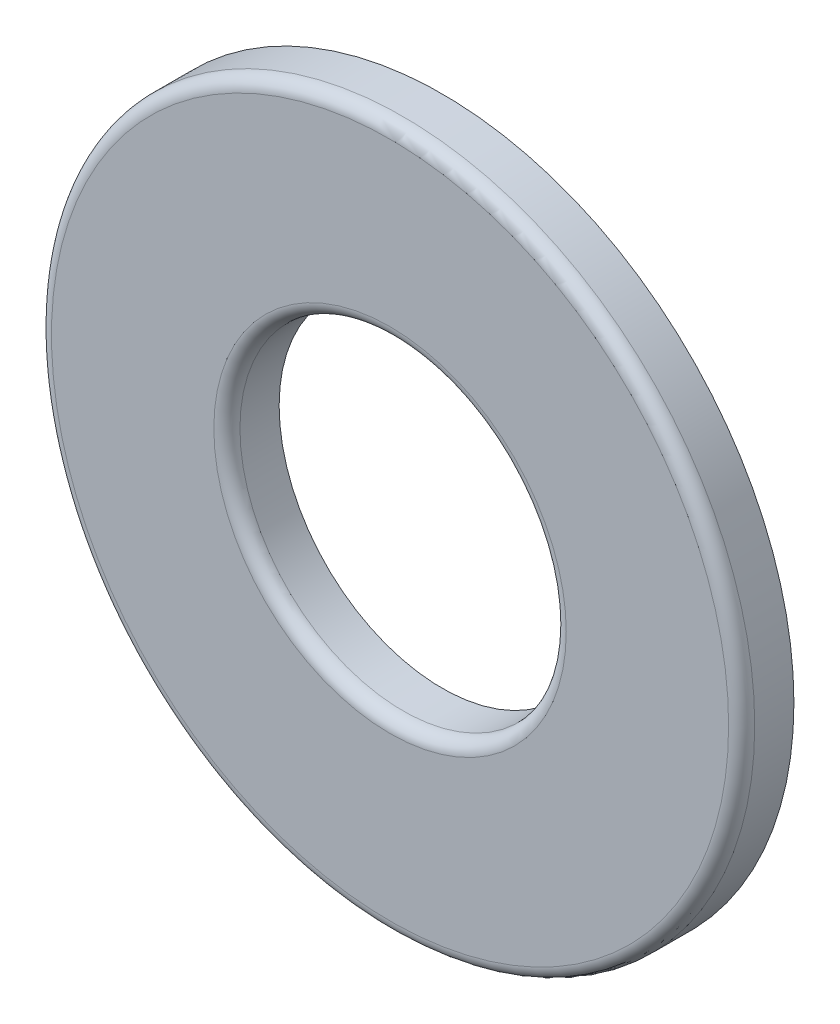
ISO-10303-21;
HEADER;
FILE_DESCRIPTION(('STEP AP214'),'2;1');
FILE_NAME('part.step','',(''),(''),'','','');
FILE_SCHEMA(('AUTOMOTIVE_DESIGN { 1 0 10303 214 1 1 1 1 }'));
ENDSEC;
DATA;
#1=APPLICATION_CONTEXT('core data for automotive mechanical design processes');
#2=APPLICATION_PROTOCOL_DEFINITION('international standard','automotive_design',2000,#1);
#3=PRODUCT_CONTEXT('',#1,'mechanical');
#4=PRODUCT('Part','Part','',(#3));
#5=PRODUCT_RELATED_PRODUCT_CATEGORY('part','',(#4));
#6=PRODUCT_DEFINITION_FORMATION('','',#4);
#7=PRODUCT_DEFINITION_CONTEXT('part definition',#1,'design');
#8=PRODUCT_DEFINITION('design','',#6,#7);
#9=PRODUCT_DEFINITION_SHAPE('','',#8);
#10=(LENGTH_UNIT() NAMED_UNIT(*) SI_UNIT(.MILLI.,.METRE.));
#11=(NAMED_UNIT(*) PLANE_ANGLE_UNIT() SI_UNIT($,.RADIAN.));
#12=(NAMED_UNIT(*) SI_UNIT($,.STERADIAN.) SOLID_ANGLE_UNIT());
#13=UNCERTAINTY_MEASURE_WITH_UNIT(LENGTH_MEASURE(1.E-05),#10,'distance_accuracy_value','');
#14=(GEOMETRIC_REPRESENTATION_CONTEXT(3) GLOBAL_UNCERTAINTY_ASSIGNED_CONTEXT((#13)) GLOBAL_UNIT_ASSIGNED_CONTEXT((#10,
#11,#12)) REPRESENTATION_CONTEXT('',''));
#15=CARTESIAN_POINT('',(0.,0.,0.));
#16=DIRECTION('',(0.,0.,1.));
#17=DIRECTION('',(1.,0.,0.));
#18=AXIS2_PLACEMENT_3D('',#15,#16,#17);
#19=CARTESIAN_POINT('',(0.,0.,0.412749999999997));
#20=DIRECTION('',(0.,0.,1.));
#21=DIRECTION('',(1.,0.,0.));
#22=AXIS2_PLACEMENT_3D('',#19,#20,#21);
#23=PLANE('',#22);
#24=CARTESIAN_POINT('',(0.,0.,0.412749999999997));
#25=DIRECTION('',(0.,0.,1.));
#26=DIRECTION('',(1.,0.,0.));
#27=AXIS2_PLACEMENT_3D('',#24,#25,#26);
#28=CIRCLE('',#27,5.349875);
#29=CARTESIAN_POINT('',(5.349875,0.,0.412749999999997));
#30=VERTEX_POINT('',#29);
#31=EDGE_CURVE('E50',#30,#30,#28,.T.);
#32=ORIENTED_EDGE('',*,*,#31,.T.);
#33=EDGE_LOOP('',(#32));
#34=FACE_BOUND('',#33,.T.);
#35=CARTESIAN_POINT('',(0.,0.,0.412749999999997));
#36=DIRECTION('',(0.,0.,1.));
#37=DIRECTION('',(1.,0.,0.));
#38=AXIS2_PLACEMENT_3D('',#35,#36,#37);
#39=CIRCLE('',#38,2.784475);
#40=CARTESIAN_POINT('',(2.784475,0.,0.412749999999997));
#41=VERTEX_POINT('',#40);
#42=EDGE_CURVE('E54',#41,#41,#39,.F.);
#43=ORIENTED_EDGE('',*,*,#42,.T.);
#44=EDGE_LOOP('',(#43));
#45=FACE_BOUND('',#44,.T.);
#46=ADVANCED_FACE('F39',(#34,#45),#23,.T.);
#47=CARTESIAN_POINT('',(0.,0.,0.412749999999997));
#48=DIRECTION('',(0.,0.,-1.));
#49=DIRECTION('',(-1.,0.,0.));
#50=AXIS2_PLACEMENT_3D('',#47,#48,#49);
#51=CYLINDRICAL_SURFACE('',#50,5.55625);
#52=CARTESIAN_POINT('',(0.,0.,0.206374999999997));
#53=DIRECTION('',(0.,0.,1.));
#54=DIRECTION('',(1.,0.,0.));
#55=AXIS2_PLACEMENT_3D('',#52,#53,#54);
#56=CIRCLE('',#55,5.55625);
#57=CARTESIAN_POINT('',(5.55625,0.,0.206374999999997));
#58=VERTEX_POINT('',#57);
#59=EDGE_CURVE('E46',#58,#58,#56,.F.);
#60=ORIENTED_EDGE('',*,*,#59,.T.);
#61=EDGE_LOOP('',(#60));
#62=FACE_BOUND('',#61,.T.);
#63=CARTESIAN_POINT('',(0.,0.,-0.412750000000003));
#64=DIRECTION('',(0.,0.,1.));
#65=DIRECTION('',(1.,0.,0.));
#66=AXIS2_PLACEMENT_3D('',#63,#64,#65);
#67=CIRCLE('',#66,5.55625);
#68=CARTESIAN_POINT('',(5.55625,0.,-0.412750000000003));
#69=VERTEX_POINT('',#68);
#70=EDGE_CURVE('E59',#69,#69,#67,.T.);
#71=ORIENTED_EDGE('',*,*,#70,.T.);
#72=EDGE_LOOP('',(#71));
#73=FACE_BOUND('',#72,.T.);
#74=ADVANCED_FACE('F71',(#62,#73),#51,.T.);
#75=CARTESIAN_POINT('',(0.,0.,0.412749999999997));
#76=DIRECTION('',(0.,0.,-1.));
#77=DIRECTION('',(-1.,0.,0.));
#78=AXIS2_PLACEMENT_3D('',#75,#76,#77);
#79=CYLINDRICAL_SURFACE('',#78,2.5781);
#80=CARTESIAN_POINT('',(0.,0.,0.206374999999997));
#81=DIRECTION('',(0.,0.,1.));
#82=DIRECTION('',(1.,0.,0.));
#83=AXIS2_PLACEMENT_3D('',#80,#81,#82);
#84=CIRCLE('',#83,2.5781);
#85=CARTESIAN_POINT('',(2.5781,0.,0.206374999999997));
#86=VERTEX_POINT('',#85);
#87=EDGE_CURVE('E10',#86,#86,#84,.T.);
#88=ORIENTED_EDGE('',*,*,#87,.T.);
#89=EDGE_LOOP('',(#88));
#90=FACE_BOUND('',#89,.T.);
#91=CARTESIAN_POINT('',(0.,0.,-0.412750000000003));
#92=DIRECTION('',(0.,0.,1.));
#93=DIRECTION('',(1.,0.,0.));
#94=AXIS2_PLACEMENT_3D('',#91,#92,#93);
#95=CIRCLE('',#94,2.5781);
#96=CARTESIAN_POINT('',(2.5781,0.,-0.412750000000003));
#97=VERTEX_POINT('',#96);
#98=EDGE_CURVE('E62',#97,#97,#95,.T.);
#99=ORIENTED_EDGE('',*,*,#98,.F.);
#100=EDGE_LOOP('',(#99));
#101=FACE_BOUND('',#100,.T.);
#102=ADVANCED_FACE('F69',(#90,#101),#79,.F.);
#103=CARTESIAN_POINT('',(0.,0.,-0.412750000000003));
#104=DIRECTION('',(0.,0.,1.));
#105=DIRECTION('',(1.,0.,0.));
#106=AXIS2_PLACEMENT_3D('',#103,#104,#105);
#107=PLANE('',#106);
#108=ORIENTED_EDGE('',*,*,#98,.T.);
#109=EDGE_LOOP('',(#108));
#110=FACE_BOUND('',#109,.T.);
#111=ORIENTED_EDGE('',*,*,#70,.F.);
#112=EDGE_LOOP('',(#111));
#113=FACE_BOUND('',#112,.T.);
#114=ADVANCED_FACE('F66',(#110,#113),#107,.F.);
#115=CARTESIAN_POINT('',(0.,0.,0.206374999999997));
#116=DIRECTION('',(0.,0.,1.));
#117=DIRECTION('',(1.,0.,0.));
#118=AXIS2_PLACEMENT_3D('',#115,#116,#117);
#119=TOROIDAL_SURFACE('',#118,5.349875,0.206375);
#120=ORIENTED_EDGE('',*,*,#59,.F.);
#121=EDGE_LOOP('',(#120));
#122=FACE_BOUND('',#121,.T.);
#123=ORIENTED_EDGE('',*,*,#31,.F.);
#124=EDGE_LOOP('',(#123));
#125=FACE_BOUND('',#124,.T.);
#126=ADVANCED_FACE('F78',(#122,#125),#119,.T.);
#127=CARTESIAN_POINT('',(0.,0.,0.206374999999997));
#128=DIRECTION('',(0.,0.,1.));
#129=DIRECTION('',(1.,0.,0.));
#130=AXIS2_PLACEMENT_3D('',#127,#128,#129);
#131=TOROIDAL_SURFACE('',#130,2.784475,0.206375);
#132=ORIENTED_EDGE('',*,*,#42,.F.);
#133=EDGE_LOOP('',(#132));
#134=FACE_BOUND('',#133,.T.);
#135=ORIENTED_EDGE('',*,*,#87,.F.);
#136=EDGE_LOOP('',(#135));
#137=FACE_BOUND('',#136,.T.);
#138=ADVANCED_FACE('F41',(#134,#137),#131,.T.);
#139=CLOSED_SHELL('',(#46,#74,#102,#114,#126,#138));
#140=MANIFOLD_SOLID_BREP('B2',#139);
#141=ADVANCED_BREP_SHAPE_REPRESENTATION('',(#18,#140),#14);
#142=SHAPE_DEFINITION_REPRESENTATION(#9,#141);
ENDSEC;
END-ISO-10303-21;
